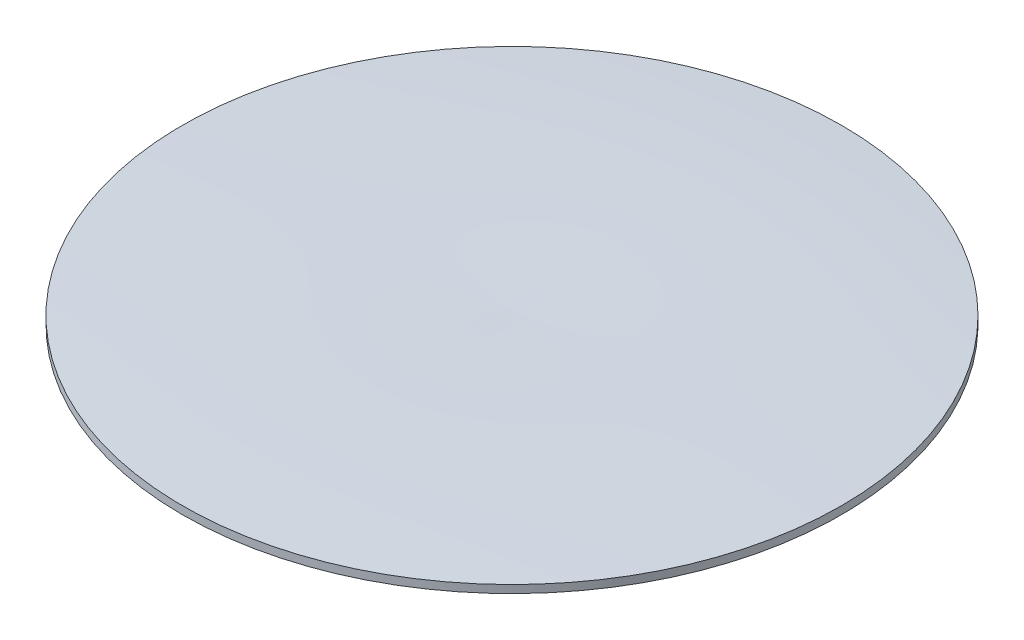
ISO-10303-21;
HEADER;
FILE_DESCRIPTION(('STEP AP214'),'2;1');
FILE_NAME('part.step','',(''),(''),'','','');
FILE_SCHEMA(('AUTOMOTIVE_DESIGN { 1 0 10303 214 1 1 1 1 }'));
ENDSEC;
DATA;
#1=APPLICATION_CONTEXT('core data for automotive mechanical design processes');
#2=APPLICATION_PROTOCOL_DEFINITION('international standard','automotive_design',2000,#1);
#3=PRODUCT_CONTEXT('',#1,'mechanical');
#4=PRODUCT('Part','Part','',(#3));
#5=PRODUCT_RELATED_PRODUCT_CATEGORY('part','',(#4));
#6=PRODUCT_DEFINITION_FORMATION('','',#4);
#7=PRODUCT_DEFINITION_CONTEXT('part definition',#1,'design');
#8=PRODUCT_DEFINITION('design','',#6,#7);
#9=PRODUCT_DEFINITION_SHAPE('','',#8);
#10=(LENGTH_UNIT() NAMED_UNIT(*) SI_UNIT(.MILLI.,.METRE.));
#11=(NAMED_UNIT(*) PLANE_ANGLE_UNIT() SI_UNIT($,.RADIAN.));
#12=(NAMED_UNIT(*) SI_UNIT($,.STERADIAN.) SOLID_ANGLE_UNIT());
#13=UNCERTAINTY_MEASURE_WITH_UNIT(LENGTH_MEASURE(1.E-05),#10,'distance_accuracy_value','');
#14=(GEOMETRIC_REPRESENTATION_CONTEXT(3) GLOBAL_UNCERTAINTY_ASSIGNED_CONTEXT((#13)) GLOBAL_UNIT_ASSIGNED_CONTEXT((#10,
#11,#12)) REPRESENTATION_CONTEXT('',''));
#15=CARTESIAN_POINT('',(0.,0.,0.));
#16=DIRECTION('',(0.,0.,1.));
#17=DIRECTION('',(1.,0.,0.));
#18=AXIS2_PLACEMENT_3D('',#15,#16,#17);
#19=CARTESIAN_POINT('',(0.,0.,0.));
#20=DIRECTION('',(0.,-1.,0.));
#21=DIRECTION('',(0.,0.,-1.));
#22=AXIS2_PLACEMENT_3D('',#19,#20,#21);
#23=PLANE('',#22);
#24=CARTESIAN_POINT('',(0.,0.,0.));
#25=DIRECTION('',(0.,-1.,0.));
#26=DIRECTION('',(0.,0.,-1.));
#27=AXIS2_PLACEMENT_3D('',#24,#25,#26);
#28=CIRCLE('',#27,84.);
#29=CARTESIAN_POINT('',(0.,0.,-84.));
#30=VERTEX_POINT('',#29);
#31=EDGE_CURVE('E11',#30,#30,#28,.T.);
#32=ORIENTED_EDGE('',*,*,#31,.T.);
#33=EDGE_LOOP('',(#32));
#34=FACE_BOUND('',#33,.T.);
#35=ADVANCED_FACE('F32',(#34),#23,.T.);
#36=CARTESIAN_POINT('',(0.,0.,0.));
#37=DIRECTION('',(0.,-1.,0.));
#38=DIRECTION('',(0.,0.,-1.));
#39=AXIS2_PLACEMENT_3D('',#36,#37,#38);
#40=CYLINDRICAL_SURFACE('',#39,84.);
#41=CARTESIAN_POINT('',(0.,2.,0.));
#42=DIRECTION('',(0.,-1.,0.));
#43=DIRECTION('',(0.,0.,-1.));
#44=AXIS2_PLACEMENT_3D('',#41,#42,#43);
#45=CIRCLE('',#44,84.);
#46=CARTESIAN_POINT('',(0.,2.,-84.));
#47=VERTEX_POINT('',#46);
#48=EDGE_CURVE('E38',#47,#47,#45,.T.);
#49=ORIENTED_EDGE('',*,*,#48,.T.);
#50=EDGE_LOOP('',(#49));
#51=FACE_BOUND('',#50,.T.);
#52=ORIENTED_EDGE('',*,*,#31,.F.);
#53=EDGE_LOOP('',(#52));
#54=FACE_BOUND('',#53,.T.);
#55=ADVANCED_FACE('F44',(#51,#54),#40,.T.);
#56=CARTESIAN_POINT('',(84.,2.,0.));
#57=CARTESIAN_POINT('',(42.0472179896773,4.49128130723975,0.));
#58=CARTESIAN_POINT('',(0.,3.,0.));
#59=B_SPLINE_CURVE_WITH_KNOTS('',2,(#56,#57,#58),.UNSPECIFIED.,.F.,.F.,(3,3),(0.,1.),.UNSPECIFIED.);
#60=CARTESIAN_POINT('',(0.,0.,0.));
#61=DIRECTION('',(0.,-1.,0.));
#62=AXIS1_PLACEMENT('',#60,#61);
#63=SURFACE_OF_REVOLUTION('',#59,#62);
#64=CARTESIAN_POINT('',(0.,3.,0.));
#65=VERTEX_POINT('',#64);
#66=VERTEX_LOOP('',#65);
#67=FACE_BOUND('',#66,.T.);
#68=ORIENTED_EDGE('',*,*,#48,.F.);
#69=EDGE_LOOP('',(#68));
#70=FACE_BOUND('',#69,.T.);
#71=ADVANCED_FACE('F41',(#67,#70),#63,.F.);
#72=CLOSED_SHELL('',(#35,#55,#71));
#73=MANIFOLD_SOLID_BREP('B2',#72);
#74=ADVANCED_BREP_SHAPE_REPRESENTATION('',(#18,#73),#14);
#75=SHAPE_DEFINITION_REPRESENTATION(#9,#74);
ENDSEC;
END-ISO-10303-21;
